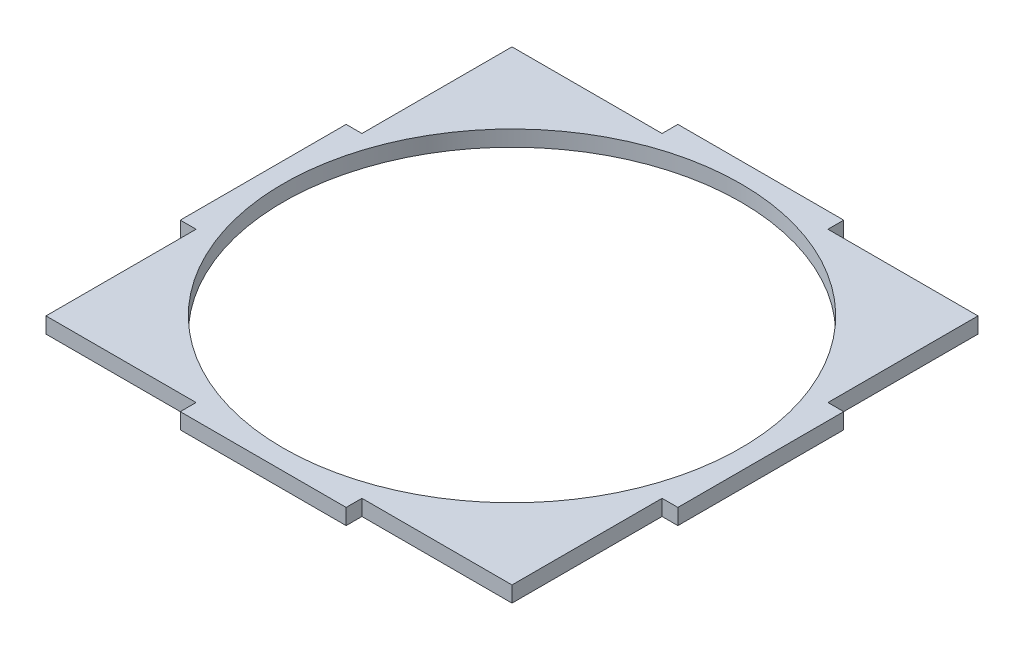
ISO-10303-21;
HEADER;
FILE_DESCRIPTION(('STEP AP214'),'2;1');
FILE_NAME('part.step','',(''),(''),'','','');
FILE_SCHEMA(('AUTOMOTIVE_DESIGN { 1 0 10303 214 1 1 1 1 }'));
ENDSEC;
DATA;
#1=APPLICATION_CONTEXT('core data for automotive mechanical design processes');
#2=APPLICATION_PROTOCOL_DEFINITION('international standard','automotive_design',2000,#1);
#3=PRODUCT_CONTEXT('',#1,'mechanical');
#4=PRODUCT('Part','Part','',(#3));
#5=PRODUCT_RELATED_PRODUCT_CATEGORY('part','',(#4));
#6=PRODUCT_DEFINITION_FORMATION('','',#4);
#7=PRODUCT_DEFINITION_CONTEXT('part definition',#1,'design');
#8=PRODUCT_DEFINITION('design','',#6,#7);
#9=PRODUCT_DEFINITION_SHAPE('','',#8);
#10=(LENGTH_UNIT() NAMED_UNIT(*) SI_UNIT(.MILLI.,.METRE.));
#11=(NAMED_UNIT(*) PLANE_ANGLE_UNIT() SI_UNIT($,.RADIAN.));
#12=(NAMED_UNIT(*) SI_UNIT($,.STERADIAN.) SOLID_ANGLE_UNIT());
#13=UNCERTAINTY_MEASURE_WITH_UNIT(LENGTH_MEASURE(1.E-05),#10,'distance_accuracy_value','');
#14=(GEOMETRIC_REPRESENTATION_CONTEXT(3) GLOBAL_UNCERTAINTY_ASSIGNED_CONTEXT((#13)) GLOBAL_UNIT_ASSIGNED_CONTEXT((#10,
#11,#12)) REPRESENTATION_CONTEXT('',''));
#15=CARTESIAN_POINT('',(0.,0.,0.));
#16=DIRECTION('',(0.,0.,1.));
#17=DIRECTION('',(1.,0.,0.));
#18=AXIS2_PLACEMENT_3D('',#15,#16,#17);
#19=CARTESIAN_POINT('',(0.,3.175,0.));
#20=DIRECTION('',(0.,-1.,0.));
#21=DIRECTION('',(0.,0.,-1.));
#22=AXIS2_PLACEMENT_3D('',#19,#20,#21);
#23=PLANE('',#22);
#24=DIRECTION('',(1.,0.,0.));
#25=VECTOR('',#24,1.);
#26=CARTESIAN_POINT('',(-50.,3.175,16.6666666666667));
#27=LINE('',#26,#25);
#28=CARTESIAN_POINT('',(-50.,3.175,16.6666666666667));
#29=VERTEX_POINT('',#28);
#30=CARTESIAN_POINT('',(-46.825,3.175,16.6666666666667));
#31=VERTEX_POINT('',#30);
#32=EDGE_CURVE('E272',#29,#31,#27,.T.);
#33=ORIENTED_EDGE('',*,*,#32,.T.);
#34=DIRECTION('',(0.,0.,1.));
#35=VECTOR('',#34,1.);
#36=CARTESIAN_POINT('',(-46.825,3.175,16.6666666666667));
#37=LINE('',#36,#35);
#38=CARTESIAN_POINT('',(-46.825,3.175,46.825));
#39=VERTEX_POINT('',#38);
#40=EDGE_CURVE('E136',#31,#39,#37,.T.);
#41=ORIENTED_EDGE('',*,*,#40,.T.);
#42=DIRECTION('',(1.,0.,0.));
#43=VECTOR('',#42,1.);
#44=CARTESIAN_POINT('',(-46.825,3.175,46.825));
#45=LINE('',#44,#43);
#46=CARTESIAN_POINT('',(-16.6666666666667,3.175,46.825));
#47=VERTEX_POINT('',#46);
#48=EDGE_CURVE('E341',#39,#47,#45,.T.);
#49=ORIENTED_EDGE('',*,*,#48,.T.);
#50=DIRECTION('',(0.,0.,1.));
#51=VECTOR('',#50,1.);
#52=CARTESIAN_POINT('',(-16.6666666666667,3.175,50.));
#53=LINE('',#52,#51);
#54=CARTESIAN_POINT('',(-16.6666666666667,3.175,50.));
#55=VERTEX_POINT('',#54);
#56=EDGE_CURVE('E361',#47,#55,#53,.T.);
#57=ORIENTED_EDGE('',*,*,#56,.T.);
#58=DIRECTION('',(1.,0.,0.));
#59=VECTOR('',#58,1.);
#60=CARTESIAN_POINT('',(-16.6666666666667,3.175,50.));
#61=LINE('',#60,#59);
#62=CARTESIAN_POINT('',(16.6666666666667,3.175,50.));
#63=VERTEX_POINT('',#62);
#64=EDGE_CURVE('E357',#55,#63,#61,.T.);
#65=ORIENTED_EDGE('',*,*,#64,.T.);
#66=DIRECTION('',(0.,0.,-1.));
#67=VECTOR('',#66,1.);
#68=CARTESIAN_POINT('',(16.6666666666667,3.175,50.));
#69=LINE('',#68,#67);
#70=CARTESIAN_POINT('',(16.6666666666667,3.175,46.825));
#71=VERTEX_POINT('',#70);
#72=EDGE_CURVE('E360',#63,#71,#69,.T.);
#73=ORIENTED_EDGE('',*,*,#72,.T.);
#74=DIRECTION('',(1.,0.,0.));
#75=VECTOR('',#74,1.);
#76=CARTESIAN_POINT('',(46.825,3.175,46.825));
#77=LINE('',#76,#75);
#78=CARTESIAN_POINT('',(46.825,3.175,46.825));
#79=VERTEX_POINT('',#78);
#80=EDGE_CURVE('E365',#71,#79,#77,.T.);
#81=ORIENTED_EDGE('',*,*,#80,.T.);
#82=DIRECTION('',(0.,0.,-1.));
#83=VECTOR('',#82,1.);
#84=CARTESIAN_POINT('',(46.825,3.175,16.6666666666667));
#85=LINE('',#84,#83);
#86=CARTESIAN_POINT('',(46.825,3.175,16.6666666666667));
#87=VERTEX_POINT('',#86);
#88=EDGE_CURVE('E372',#79,#87,#85,.T.);
#89=ORIENTED_EDGE('',*,*,#88,.T.);
#90=DIRECTION('',(1.,0.,0.));
#91=VECTOR('',#90,1.);
#92=CARTESIAN_POINT('',(50.,3.175,16.6666666666667));
#93=LINE('',#92,#91);
#94=CARTESIAN_POINT('',(50.,3.175,16.6666666666667));
#95=VERTEX_POINT('',#94);
#96=EDGE_CURVE('E375',#87,#95,#93,.T.);
#97=ORIENTED_EDGE('',*,*,#96,.T.);
#98=DIRECTION('',(0.,0.,-1.));
#99=VECTOR('',#98,1.);
#100=CARTESIAN_POINT('',(50.,3.175,16.6666666666667));
#101=LINE('',#100,#99);
#102=CARTESIAN_POINT('',(50.,3.175,-16.6666666666667));
#103=VERTEX_POINT('',#102);
#104=EDGE_CURVE('E378',#95,#103,#101,.T.);
#105=ORIENTED_EDGE('',*,*,#104,.T.);
#106=DIRECTION('',(-1.,0.,0.));
#107=VECTOR('',#106,1.);
#108=CARTESIAN_POINT('',(50.,3.175,-16.6666666666667));
#109=LINE('',#108,#107);
#110=CARTESIAN_POINT('',(46.825,3.175,-16.6666666666667));
#111=VERTEX_POINT('',#110);
#112=EDGE_CURVE('E381',#103,#111,#109,.T.);
#113=ORIENTED_EDGE('',*,*,#112,.T.);
#114=DIRECTION('',(0.,0.,-1.));
#115=VECTOR('',#114,1.);
#116=CARTESIAN_POINT('',(46.825,3.175,-46.825));
#117=LINE('',#116,#115);
#118=CARTESIAN_POINT('',(46.825,3.175,-46.825));
#119=VERTEX_POINT('',#118);
#120=EDGE_CURVE('E384',#111,#119,#117,.T.);
#121=ORIENTED_EDGE('',*,*,#120,.T.);
#122=DIRECTION('',(-1.,0.,0.));
#123=VECTOR('',#122,1.);
#124=CARTESIAN_POINT('',(16.6666666666667,3.175,-46.825));
#125=LINE('',#124,#123);
#126=CARTESIAN_POINT('',(16.6666666666667,3.175,-46.825));
#127=VERTEX_POINT('',#126);
#128=EDGE_CURVE('E387',#119,#127,#125,.T.);
#129=ORIENTED_EDGE('',*,*,#128,.T.);
#130=DIRECTION('',(0.,0.,-1.));
#131=VECTOR('',#130,1.);
#132=CARTESIAN_POINT('',(16.6666666666667,3.175,-50.));
#133=LINE('',#132,#131);
#134=CARTESIAN_POINT('',(16.6666666666667,3.175,-50.));
#135=VERTEX_POINT('',#134);
#136=EDGE_CURVE('E390',#127,#135,#133,.T.);
#137=ORIENTED_EDGE('',*,*,#136,.T.);
#138=DIRECTION('',(-1.,0.,0.));
#139=VECTOR('',#138,1.);
#140=CARTESIAN_POINT('',(-16.6666666666667,3.175,-50.));
#141=LINE('',#140,#139);
#142=CARTESIAN_POINT('',(-16.6666666666667,3.175,-50.));
#143=VERTEX_POINT('',#142);
#144=EDGE_CURVE('E393',#135,#143,#141,.T.);
#145=ORIENTED_EDGE('',*,*,#144,.T.);
#146=DIRECTION('',(0.,0.,1.));
#147=VECTOR('',#146,1.);
#148=CARTESIAN_POINT('',(-16.6666666666667,3.175,-50.));
#149=LINE('',#148,#147);
#150=CARTESIAN_POINT('',(-16.6666666666667,3.175,-46.825));
#151=VERTEX_POINT('',#150);
#152=EDGE_CURVE('E396',#143,#151,#149,.T.);
#153=ORIENTED_EDGE('',*,*,#152,.T.);
#154=DIRECTION('',(-1.,0.,0.));
#155=VECTOR('',#154,1.);
#156=CARTESIAN_POINT('',(-16.6666666666667,3.175,-46.825));
#157=LINE('',#156,#155);
#158=CARTESIAN_POINT('',(-46.825,3.175,-46.825));
#159=VERTEX_POINT('',#158);
#160=EDGE_CURVE('E191',#151,#159,#157,.T.);
#161=ORIENTED_EDGE('',*,*,#160,.T.);
#162=DIRECTION('',(0.,0.,1.));
#163=VECTOR('',#162,1.);
#164=CARTESIAN_POINT('',(-46.825,3.175,-46.825));
#165=LINE('',#164,#163);
#166=CARTESIAN_POINT('',(-46.825,3.175,-16.6666666666667));
#167=VERTEX_POINT('',#166);
#168=EDGE_CURVE('E185',#159,#167,#165,.T.);
#169=ORIENTED_EDGE('',*,*,#168,.T.);
#170=DIRECTION('',(-1.,0.,0.));
#171=VECTOR('',#170,1.);
#172=CARTESIAN_POINT('',(-50.,3.175,-16.6666666666667));
#173=LINE('',#172,#171);
#174=CARTESIAN_POINT('',(-50.,3.175,-16.6666666666667));
#175=VERTEX_POINT('',#174);
#176=EDGE_CURVE('E189',#167,#175,#173,.T.);
#177=ORIENTED_EDGE('',*,*,#176,.T.);
#178=DIRECTION('',(0.,0.,1.));
#179=VECTOR('',#178,1.);
#180=CARTESIAN_POINT('',(-50.,3.175,16.6666666666667));
#181=LINE('',#180,#179);
#182=EDGE_CURVE('E57',#175,#29,#181,.T.);
#183=ORIENTED_EDGE('',*,*,#182,.T.);
#184=EDGE_LOOP('',(#33,#41,#49,#57,#65,#73,#81,#89,#97,#105,#113,#121,#129,#137,#145,#153,#161,
#169,#177,#183));
#185=FACE_BOUND('',#184,.T.);
#186=CARTESIAN_POINT('',(0.,3.175,0.));
#187=DIRECTION('',(0.,1.,0.));
#188=DIRECTION('',(0.,0.,1.));
#189=AXIS2_PLACEMENT_3D('',#186,#187,#188);
#190=CIRCLE('',#189,46.);
#191=CARTESIAN_POINT('',(0.,3.175,46.));
#192=VERTEX_POINT('',#191);
#193=EDGE_CURVE('E218',#192,#192,#190,.T.);
#194=ORIENTED_EDGE('',*,*,#193,.F.);
#195=EDGE_LOOP('',(#194));
#196=FACE_BOUND('',#195,.T.);
#197=ADVANCED_FACE('F39',(#185,#196),#23,.F.);
#198=CARTESIAN_POINT('',(0.,0.,0.));
#199=DIRECTION('',(0.,-1.,0.));
#200=DIRECTION('',(0.,0.,-1.));
#201=AXIS2_PLACEMENT_3D('',#198,#199,#200);
#202=PLANE('',#201);
#203=DIRECTION('',(1.,0.,0.));
#204=VECTOR('',#203,1.);
#205=CARTESIAN_POINT('',(-50.,0.,16.6666666666667));
#206=LINE('',#205,#204);
#207=CARTESIAN_POINT('',(-50.,0.,16.6666666666667));
#208=VERTEX_POINT('',#207);
#209=CARTESIAN_POINT('',(-46.825,0.,16.6666666666667));
#210=VERTEX_POINT('',#209);
#211=EDGE_CURVE('E213',#208,#210,#206,.T.);
#212=ORIENTED_EDGE('',*,*,#211,.F.);
#213=DIRECTION('',(0.,0.,1.));
#214=VECTOR('',#213,1.);
#215=CARTESIAN_POINT('',(-50.,0.,16.6666666666667));
#216=LINE('',#215,#214);
#217=CARTESIAN_POINT('',(-50.,0.,-16.6666666666667));
#218=VERTEX_POINT('',#217);
#219=EDGE_CURVE('E128',#218,#208,#216,.T.);
#220=ORIENTED_EDGE('',*,*,#219,.F.);
#221=DIRECTION('',(-1.,0.,0.));
#222=VECTOR('',#221,1.);
#223=CARTESIAN_POINT('',(-50.,0.,-16.6666666666667));
#224=LINE('',#223,#222);
#225=CARTESIAN_POINT('',(-46.825,0.,-16.6666666666667));
#226=VERTEX_POINT('',#225);
#227=EDGE_CURVE('E122',#226,#218,#224,.T.);
#228=ORIENTED_EDGE('',*,*,#227,.F.);
#229=DIRECTION('',(0.,0.,1.));
#230=VECTOR('',#229,1.);
#231=CARTESIAN_POINT('',(-46.825,0.,-46.825));
#232=LINE('',#231,#230);
#233=CARTESIAN_POINT('',(-46.825,0.,-46.825));
#234=VERTEX_POINT('',#233);
#235=EDGE_CURVE('E200',#234,#226,#232,.T.);
#236=ORIENTED_EDGE('',*,*,#235,.F.);
#237=DIRECTION('',(-1.,0.,0.));
#238=VECTOR('',#237,1.);
#239=CARTESIAN_POINT('',(-16.6666666666667,0.,-46.825));
#240=LINE('',#239,#238);
#241=CARTESIAN_POINT('',(-16.6666666666667,0.,-46.825));
#242=VERTEX_POINT('',#241);
#243=EDGE_CURVE('E263',#242,#234,#240,.T.);
#244=ORIENTED_EDGE('',*,*,#243,.F.);
#245=DIRECTION('',(0.,0.,1.));
#246=VECTOR('',#245,1.);
#247=CARTESIAN_POINT('',(-16.6666666666667,0.,-50.));
#248=LINE('',#247,#246);
#249=CARTESIAN_POINT('',(-16.6666666666667,0.,-50.));
#250=VERTEX_POINT('',#249);
#251=EDGE_CURVE('E260',#250,#242,#248,.T.);
#252=ORIENTED_EDGE('',*,*,#251,.F.);
#253=DIRECTION('',(-1.,0.,0.));
#254=VECTOR('',#253,1.);
#255=CARTESIAN_POINT('',(-16.6666666666667,0.,-50.));
#256=LINE('',#255,#254);
#257=CARTESIAN_POINT('',(16.6666666666667,0.,-50.));
#258=VERTEX_POINT('',#257);
#259=EDGE_CURVE('E257',#258,#250,#256,.T.);
#260=ORIENTED_EDGE('',*,*,#259,.F.);
#261=DIRECTION('',(0.,0.,-1.));
#262=VECTOR('',#261,1.);
#263=CARTESIAN_POINT('',(16.6666666666667,0.,-50.));
#264=LINE('',#263,#262);
#265=CARTESIAN_POINT('',(16.6666666666667,0.,-46.825));
#266=VERTEX_POINT('',#265);
#267=EDGE_CURVE('E254',#266,#258,#264,.T.);
#268=ORIENTED_EDGE('',*,*,#267,.F.);
#269=DIRECTION('',(-1.,0.,0.));
#270=VECTOR('',#269,1.);
#271=CARTESIAN_POINT('',(16.6666666666667,0.,-46.825));
#272=LINE('',#271,#270);
#273=CARTESIAN_POINT('',(46.825,0.,-46.825));
#274=VERTEX_POINT('',#273);
#275=EDGE_CURVE('E251',#274,#266,#272,.T.);
#276=ORIENTED_EDGE('',*,*,#275,.F.);
#277=DIRECTION('',(0.,0.,-1.));
#278=VECTOR('',#277,1.);
#279=CARTESIAN_POINT('',(46.825,0.,-46.825));
#280=LINE('',#279,#278);
#281=CARTESIAN_POINT('',(46.825,0.,-16.6666666666667));
#282=VERTEX_POINT('',#281);
#283=EDGE_CURVE('E248',#282,#274,#280,.T.);
#284=ORIENTED_EDGE('',*,*,#283,.F.);
#285=DIRECTION('',(-1.,0.,0.));
#286=VECTOR('',#285,1.);
#287=CARTESIAN_POINT('',(50.,0.,-16.6666666666667));
#288=LINE('',#287,#286);
#289=CARTESIAN_POINT('',(50.,0.,-16.6666666666667));
#290=VERTEX_POINT('',#289);
#291=EDGE_CURVE('E245',#290,#282,#288,.T.);
#292=ORIENTED_EDGE('',*,*,#291,.F.);
#293=DIRECTION('',(0.,0.,-1.));
#294=VECTOR('',#293,1.);
#295=CARTESIAN_POINT('',(50.,0.,16.6666666666667));
#296=LINE('',#295,#294);
#297=CARTESIAN_POINT('',(50.,0.,16.6666666666667));
#298=VERTEX_POINT('',#297);
#299=EDGE_CURVE('E242',#298,#290,#296,.T.);
#300=ORIENTED_EDGE('',*,*,#299,.F.);
#301=DIRECTION('',(1.,0.,0.));
#302=VECTOR('',#301,1.);
#303=CARTESIAN_POINT('',(50.,0.,16.6666666666667));
#304=LINE('',#303,#302);
#305=CARTESIAN_POINT('',(46.825,0.,16.6666666666667));
#306=VERTEX_POINT('',#305);
#307=EDGE_CURVE('E239',#306,#298,#304,.T.);
#308=ORIENTED_EDGE('',*,*,#307,.F.);
#309=DIRECTION('',(0.,0.,-1.));
#310=VECTOR('',#309,1.);
#311=CARTESIAN_POINT('',(46.825,0.,16.6666666666667));
#312=LINE('',#311,#310);
#313=CARTESIAN_POINT('',(46.825,0.,46.825));
#314=VERTEX_POINT('',#313);
#315=EDGE_CURVE('E236',#314,#306,#312,.T.);
#316=ORIENTED_EDGE('',*,*,#315,.F.);
#317=DIRECTION('',(1.,0.,0.));
#318=VECTOR('',#317,1.);
#319=CARTESIAN_POINT('',(46.825,0.,46.825));
#320=LINE('',#319,#318);
#321=CARTESIAN_POINT('',(16.6666666666667,0.,46.825));
#322=VERTEX_POINT('',#321);
#323=EDGE_CURVE('E233',#322,#314,#320,.T.);
#324=ORIENTED_EDGE('',*,*,#323,.F.);
#325=DIRECTION('',(0.,0.,-1.));
#326=VECTOR('',#325,1.);
#327=CARTESIAN_POINT('',(16.6666666666667,0.,50.));
#328=LINE('',#327,#326);
#329=CARTESIAN_POINT('',(16.6666666666667,0.,50.));
#330=VERTEX_POINT('',#329);
#331=EDGE_CURVE('E230',#330,#322,#328,.T.);
#332=ORIENTED_EDGE('',*,*,#331,.F.);
#333=DIRECTION('',(1.,0.,0.));
#334=VECTOR('',#333,1.);
#335=CARTESIAN_POINT('',(-16.6666666666667,0.,50.));
#336=LINE('',#335,#334);
#337=CARTESIAN_POINT('',(-16.6666666666667,0.,50.));
#338=VERTEX_POINT('',#337);
#339=EDGE_CURVE('E227',#338,#330,#336,.T.);
#340=ORIENTED_EDGE('',*,*,#339,.F.);
#341=DIRECTION('',(0.,0.,1.));
#342=VECTOR('',#341,1.);
#343=CARTESIAN_POINT('',(-16.6666666666667,0.,50.));
#344=LINE('',#343,#342);
#345=CARTESIAN_POINT('',(-16.6666666666667,0.,46.825));
#346=VERTEX_POINT('',#345);
#347=EDGE_CURVE('E224',#346,#338,#344,.T.);
#348=ORIENTED_EDGE('',*,*,#347,.F.);
#349=DIRECTION('',(1.,0.,0.));
#350=VECTOR('',#349,1.);
#351=CARTESIAN_POINT('',(-46.825,0.,46.825));
#352=LINE('',#351,#350);
#353=CARTESIAN_POINT('',(-46.825,0.,46.825));
#354=VERTEX_POINT('',#353);
#355=EDGE_CURVE('E221',#354,#346,#352,.T.);
#356=ORIENTED_EDGE('',*,*,#355,.F.);
#357=DIRECTION('',(0.,0.,1.));
#358=VECTOR('',#357,1.);
#359=CARTESIAN_POINT('',(-46.825,0.,16.6666666666667));
#360=LINE('',#359,#358);
#361=EDGE_CURVE('E217',#210,#354,#360,.T.);
#362=ORIENTED_EDGE('',*,*,#361,.F.);
#363=EDGE_LOOP('',(#212,#220,#228,#236,#244,#252,#260,#268,#276,#284,#292,#300,#308,#316,#324,
#332,#340,#348,#356,#362));
#364=FACE_BOUND('',#363,.T.);
#365=CARTESIAN_POINT('',(0.,0.,0.));
#366=DIRECTION('',(0.,1.,0.));
#367=DIRECTION('',(0.,0.,1.));
#368=AXIS2_PLACEMENT_3D('',#365,#366,#367);
#369=CIRCLE('',#368,46.);
#370=CARTESIAN_POINT('',(0.,0.,46.));
#371=VERTEX_POINT('',#370);
#372=EDGE_CURVE('E649',#371,#371,#369,.T.);
#373=ORIENTED_EDGE('',*,*,#372,.T.);
#374=EDGE_LOOP('',(#373));
#375=FACE_BOUND('',#374,.T.);
#376=ADVANCED_FACE('F345',(#364,#375),#202,.T.);
#377=CARTESIAN_POINT('',(-50.,3.175,16.6666666666667));
#378=DIRECTION('',(0.,0.,-1.));
#379=DIRECTION('',(-1.,0.,0.));
#380=AXIS2_PLACEMENT_3D('',#377,#378,#379);
#381=PLANE('',#380);
#382=ORIENTED_EDGE('',*,*,#211,.T.);
#383=DIRECTION('',(0.,-1.,0.));
#384=VECTOR('',#383,1.);
#385=CARTESIAN_POINT('',(-46.825,3.175,16.6666666666667));
#386=LINE('',#385,#384);
#387=EDGE_CURVE('E11',#31,#210,#386,.T.);
#388=ORIENTED_EDGE('',*,*,#387,.F.);
#389=ORIENTED_EDGE('',*,*,#32,.F.);
#390=DIRECTION('',(0.,-1.,0.));
#391=VECTOR('',#390,1.);
#392=CARTESIAN_POINT('',(-50.,3.175,16.6666666666667));
#393=LINE('',#392,#391);
#394=EDGE_CURVE('E209',#29,#208,#393,.T.);
#395=ORIENTED_EDGE('',*,*,#394,.T.);
#396=EDGE_LOOP('',(#382,#388,#389,#395));
#397=FACE_BOUND('',#396,.T.);
#398=ADVANCED_FACE('F41',(#397),#381,.F.);
#399=CARTESIAN_POINT('',(-46.825,3.175,16.6666666666667));
#400=DIRECTION('',(1.,0.,0.));
#401=DIRECTION('',(0.,0.,-1.));
#402=AXIS2_PLACEMENT_3D('',#399,#400,#401);
#403=PLANE('',#402);
#404=ORIENTED_EDGE('',*,*,#361,.T.);
#405=DIRECTION('',(0.,-1.,0.));
#406=VECTOR('',#405,1.);
#407=CARTESIAN_POINT('',(-46.825,3.175,46.825));
#408=LINE('',#407,#406);
#409=EDGE_CURVE('E49',#39,#354,#408,.T.);
#410=ORIENTED_EDGE('',*,*,#409,.F.);
#411=ORIENTED_EDGE('',*,*,#40,.F.);
#412=ORIENTED_EDGE('',*,*,#387,.T.);
#413=EDGE_LOOP('',(#404,#410,#411,#412));
#414=FACE_BOUND('',#413,.T.);
#415=ADVANCED_FACE('F432',(#414),#403,.F.);
#416=CARTESIAN_POINT('',(-46.825,3.175,46.825));
#417=DIRECTION('',(0.,0.,-1.));
#418=DIRECTION('',(-1.,0.,0.));
#419=AXIS2_PLACEMENT_3D('',#416,#417,#418);
#420=PLANE('',#419);
#421=ORIENTED_EDGE('',*,*,#355,.T.);
#422=DIRECTION('',(0.,-1.,0.));
#423=VECTOR('',#422,1.);
#424=CARTESIAN_POINT('',(-16.6666666666667,3.175,46.825));
#425=LINE('',#424,#423);
#426=EDGE_CURVE('E331',#47,#346,#425,.T.);
#427=ORIENTED_EDGE('',*,*,#426,.F.);
#428=ORIENTED_EDGE('',*,*,#48,.F.);
#429=ORIENTED_EDGE('',*,*,#409,.T.);
#430=EDGE_LOOP('',(#421,#427,#428,#429));
#431=FACE_BOUND('',#430,.T.);
#432=ADVANCED_FACE('F339',(#431),#420,.F.);
#433=CARTESIAN_POINT('',(-16.6666666666667,3.175,50.));
#434=DIRECTION('',(1.,0.,0.));
#435=DIRECTION('',(0.,0.,-1.));
#436=AXIS2_PLACEMENT_3D('',#433,#434,#435);
#437=PLANE('',#436);
#438=ORIENTED_EDGE('',*,*,#347,.T.);
#439=DIRECTION('',(0.,-1.,0.));
#440=VECTOR('',#439,1.);
#441=CARTESIAN_POINT('',(-16.6666666666667,3.175,50.));
#442=LINE('',#441,#440);
#443=EDGE_CURVE('E327',#55,#338,#442,.T.);
#444=ORIENTED_EDGE('',*,*,#443,.F.);
#445=ORIENTED_EDGE('',*,*,#56,.F.);
#446=ORIENTED_EDGE('',*,*,#426,.T.);
#447=EDGE_LOOP('',(#438,#444,#445,#446));
#448=FACE_BOUND('',#447,.T.);
#449=ADVANCED_FACE('F351',(#448),#437,.F.);
#450=CARTESIAN_POINT('',(-16.6666666666667,3.175,50.));
#451=DIRECTION('',(0.,0.,-1.));
#452=DIRECTION('',(-1.,0.,0.));
#453=AXIS2_PLACEMENT_3D('',#450,#451,#452);
#454=PLANE('',#453);
#455=ORIENTED_EDGE('',*,*,#339,.T.);
#456=DIRECTION('',(0.,-1.,0.));
#457=VECTOR('',#456,1.);
#458=CARTESIAN_POINT('',(16.6666666666667,3.175,50.));
#459=LINE('',#458,#457);
#460=EDGE_CURVE('E323',#63,#330,#459,.T.);
#461=ORIENTED_EDGE('',*,*,#460,.F.);
#462=ORIENTED_EDGE('',*,*,#64,.F.);
#463=ORIENTED_EDGE('',*,*,#443,.T.);
#464=EDGE_LOOP('',(#455,#461,#462,#463));
#465=FACE_BOUND('',#464,.T.);
#466=ADVANCED_FACE('F355',(#465),#454,.F.);
#467=CARTESIAN_POINT('',(16.6666666666667,3.175,50.));
#468=DIRECTION('',(-1.,0.,0.));
#469=DIRECTION('',(0.,0.,1.));
#470=AXIS2_PLACEMENT_3D('',#467,#468,#469);
#471=PLANE('',#470);
#472=ORIENTED_EDGE('',*,*,#331,.T.);
#473=DIRECTION('',(0.,-1.,0.));
#474=VECTOR('',#473,1.);
#475=CARTESIAN_POINT('',(16.6666666666667,3.175,46.825));
#476=LINE('',#475,#474);
#477=EDGE_CURVE('E319',#71,#322,#476,.T.);
#478=ORIENTED_EDGE('',*,*,#477,.F.);
#479=ORIENTED_EDGE('',*,*,#72,.F.);
#480=ORIENTED_EDGE('',*,*,#460,.T.);
#481=EDGE_LOOP('',(#472,#478,#479,#480));
#482=FACE_BOUND('',#481,.T.);
#483=ADVANCED_FACE('F445',(#482),#471,.F.);
#484=CARTESIAN_POINT('',(46.825,3.175,46.825));
#485=DIRECTION('',(0.,0.,-1.));
#486=DIRECTION('',(-1.,0.,0.));
#487=AXIS2_PLACEMENT_3D('',#484,#485,#486);
#488=PLANE('',#487);
#489=ORIENTED_EDGE('',*,*,#323,.T.);
#490=DIRECTION('',(0.,-1.,0.));
#491=VECTOR('',#490,1.);
#492=CARTESIAN_POINT('',(46.825,3.175,46.825));
#493=LINE('',#492,#491);
#494=EDGE_CURVE('E315',#79,#314,#493,.T.);
#495=ORIENTED_EDGE('',*,*,#494,.F.);
#496=ORIENTED_EDGE('',*,*,#80,.F.);
#497=ORIENTED_EDGE('',*,*,#477,.T.);
#498=EDGE_LOOP('',(#489,#495,#496,#497));
#499=FACE_BOUND('',#498,.T.);
#500=ADVANCED_FACE('F448',(#499),#488,.F.);
#501=CARTESIAN_POINT('',(46.825,3.175,16.6666666666667));
#502=DIRECTION('',(-1.,0.,0.));
#503=DIRECTION('',(0.,0.,1.));
#504=AXIS2_PLACEMENT_3D('',#501,#502,#503);
#505=PLANE('',#504);
#506=ORIENTED_EDGE('',*,*,#315,.T.);
#507=DIRECTION('',(0.,-1.,0.));
#508=VECTOR('',#507,1.);
#509=CARTESIAN_POINT('',(46.825,3.175,16.6666666666667));
#510=LINE('',#509,#508);
#511=EDGE_CURVE('E311',#87,#306,#510,.T.);
#512=ORIENTED_EDGE('',*,*,#511,.F.);
#513=ORIENTED_EDGE('',*,*,#88,.F.);
#514=ORIENTED_EDGE('',*,*,#494,.T.);
#515=EDGE_LOOP('',(#506,#512,#513,#514));
#516=FACE_BOUND('',#515,.T.);
#517=ADVANCED_FACE('F452',(#516),#505,.F.);
#518=CARTESIAN_POINT('',(50.,3.175,16.6666666666667));
#519=DIRECTION('',(0.,0.,-1.));
#520=DIRECTION('',(-1.,0.,0.));
#521=AXIS2_PLACEMENT_3D('',#518,#519,#520);
#522=PLANE('',#521);
#523=ORIENTED_EDGE('',*,*,#307,.T.);
#524=DIRECTION('',(0.,-1.,0.));
#525=VECTOR('',#524,1.);
#526=CARTESIAN_POINT('',(50.,3.175,16.6666666666667));
#527=LINE('',#526,#525);
#528=EDGE_CURVE('E307',#95,#298,#527,.T.);
#529=ORIENTED_EDGE('',*,*,#528,.F.);
#530=ORIENTED_EDGE('',*,*,#96,.F.);
#531=ORIENTED_EDGE('',*,*,#511,.T.);
#532=EDGE_LOOP('',(#523,#529,#530,#531));
#533=FACE_BOUND('',#532,.T.);
#534=ADVANCED_FACE('F456',(#533),#522,.F.);
#535=CARTESIAN_POINT('',(50.,3.175,16.6666666666667));
#536=DIRECTION('',(-1.,0.,0.));
#537=DIRECTION('',(0.,0.,1.));
#538=AXIS2_PLACEMENT_3D('',#535,#536,#537);
#539=PLANE('',#538);
#540=ORIENTED_EDGE('',*,*,#299,.T.);
#541=DIRECTION('',(0.,-1.,0.));
#542=VECTOR('',#541,1.);
#543=CARTESIAN_POINT('',(50.,3.175,-16.6666666666667));
#544=LINE('',#543,#542);
#545=EDGE_CURVE('E303',#103,#290,#544,.T.);
#546=ORIENTED_EDGE('',*,*,#545,.F.);
#547=ORIENTED_EDGE('',*,*,#104,.F.);
#548=ORIENTED_EDGE('',*,*,#528,.T.);
#549=EDGE_LOOP('',(#540,#546,#547,#548));
#550=FACE_BOUND('',#549,.T.);
#551=ADVANCED_FACE('F460',(#550),#539,.F.);
#552=CARTESIAN_POINT('',(50.,3.175,-16.6666666666667));
#553=DIRECTION('',(0.,0.,1.));
#554=DIRECTION('',(1.,0.,0.));
#555=AXIS2_PLACEMENT_3D('',#552,#553,#554);
#556=PLANE('',#555);
#557=ORIENTED_EDGE('',*,*,#291,.T.);
#558=DIRECTION('',(0.,-1.,0.));
#559=VECTOR('',#558,1.);
#560=CARTESIAN_POINT('',(46.825,3.175,-16.6666666666667));
#561=LINE('',#560,#559);
#562=EDGE_CURVE('E299',#111,#282,#561,.T.);
#563=ORIENTED_EDGE('',*,*,#562,.F.);
#564=ORIENTED_EDGE('',*,*,#112,.F.);
#565=ORIENTED_EDGE('',*,*,#545,.T.);
#566=EDGE_LOOP('',(#557,#563,#564,#565));
#567=FACE_BOUND('',#566,.T.);
#568=ADVANCED_FACE('F464',(#567),#556,.F.);
#569=CARTESIAN_POINT('',(46.825,3.175,-46.825));
#570=DIRECTION('',(-1.,0.,0.));
#571=DIRECTION('',(0.,0.,1.));
#572=AXIS2_PLACEMENT_3D('',#569,#570,#571);
#573=PLANE('',#572);
#574=ORIENTED_EDGE('',*,*,#283,.T.);
#575=DIRECTION('',(0.,-1.,0.));
#576=VECTOR('',#575,1.);
#577=CARTESIAN_POINT('',(46.825,3.175,-46.825));
#578=LINE('',#577,#576);
#579=EDGE_CURVE('E295',#119,#274,#578,.T.);
#580=ORIENTED_EDGE('',*,*,#579,.F.);
#581=ORIENTED_EDGE('',*,*,#120,.F.);
#582=ORIENTED_EDGE('',*,*,#562,.T.);
#583=EDGE_LOOP('',(#574,#580,#581,#582));
#584=FACE_BOUND('',#583,.T.);
#585=ADVANCED_FACE('F468',(#584),#573,.F.);
#586=CARTESIAN_POINT('',(16.6666666666667,3.175,-46.825));
#587=DIRECTION('',(0.,0.,1.));
#588=DIRECTION('',(1.,0.,0.));
#589=AXIS2_PLACEMENT_3D('',#586,#587,#588);
#590=PLANE('',#589);
#591=ORIENTED_EDGE('',*,*,#275,.T.);
#592=DIRECTION('',(0.,-1.,0.));
#593=VECTOR('',#592,1.);
#594=CARTESIAN_POINT('',(16.6666666666667,3.175,-46.825));
#595=LINE('',#594,#593);
#596=EDGE_CURVE('E291',#127,#266,#595,.T.);
#597=ORIENTED_EDGE('',*,*,#596,.F.);
#598=ORIENTED_EDGE('',*,*,#128,.F.);
#599=ORIENTED_EDGE('',*,*,#579,.T.);
#600=EDGE_LOOP('',(#591,#597,#598,#599));
#601=FACE_BOUND('',#600,.T.);
#602=ADVANCED_FACE('F472',(#601),#590,.F.);
#603=CARTESIAN_POINT('',(16.6666666666667,3.175,-50.));
#604=DIRECTION('',(-1.,0.,0.));
#605=DIRECTION('',(0.,0.,1.));
#606=AXIS2_PLACEMENT_3D('',#603,#604,#605);
#607=PLANE('',#606);
#608=ORIENTED_EDGE('',*,*,#267,.T.);
#609=DIRECTION('',(0.,-1.,0.));
#610=VECTOR('',#609,1.);
#611=CARTESIAN_POINT('',(16.6666666666667,3.175,-50.));
#612=LINE('',#611,#610);
#613=EDGE_CURVE('E287',#135,#258,#612,.T.);
#614=ORIENTED_EDGE('',*,*,#613,.F.);
#615=ORIENTED_EDGE('',*,*,#136,.F.);
#616=ORIENTED_EDGE('',*,*,#596,.T.);
#617=EDGE_LOOP('',(#608,#614,#615,#616));
#618=FACE_BOUND('',#617,.T.);
#619=ADVANCED_FACE('F476',(#618),#607,.F.);
#620=CARTESIAN_POINT('',(-16.6666666666667,3.175,-50.));
#621=DIRECTION('',(0.,0.,1.));
#622=DIRECTION('',(1.,0.,0.));
#623=AXIS2_PLACEMENT_3D('',#620,#621,#622);
#624=PLANE('',#623);
#625=ORIENTED_EDGE('',*,*,#259,.T.);
#626=DIRECTION('',(0.,-1.,0.));
#627=VECTOR('',#626,1.);
#628=CARTESIAN_POINT('',(-16.6666666666667,3.175,-50.));
#629=LINE('',#628,#627);
#630=EDGE_CURVE('E283',#143,#250,#629,.T.);
#631=ORIENTED_EDGE('',*,*,#630,.F.);
#632=ORIENTED_EDGE('',*,*,#144,.F.);
#633=ORIENTED_EDGE('',*,*,#613,.T.);
#634=EDGE_LOOP('',(#625,#631,#632,#633));
#635=FACE_BOUND('',#634,.T.);
#636=ADVANCED_FACE('F480',(#635),#624,.F.);
#637=CARTESIAN_POINT('',(-16.6666666666667,3.175,-50.));
#638=DIRECTION('',(1.,0.,0.));
#639=DIRECTION('',(0.,0.,-1.));
#640=AXIS2_PLACEMENT_3D('',#637,#638,#639);
#641=PLANE('',#640);
#642=ORIENTED_EDGE('',*,*,#251,.T.);
#643=DIRECTION('',(0.,-1.,0.));
#644=VECTOR('',#643,1.);
#645=CARTESIAN_POINT('',(-16.6666666666667,3.175,-46.825));
#646=LINE('',#645,#644);
#647=EDGE_CURVE('E279',#151,#242,#646,.T.);
#648=ORIENTED_EDGE('',*,*,#647,.F.);
#649=ORIENTED_EDGE('',*,*,#152,.F.);
#650=ORIENTED_EDGE('',*,*,#630,.T.);
#651=EDGE_LOOP('',(#642,#648,#649,#650));
#652=FACE_BOUND('',#651,.T.);
#653=ADVANCED_FACE('F404',(#652),#641,.F.);
#654=CARTESIAN_POINT('',(-16.6666666666667,3.175,-46.825));
#655=DIRECTION('',(0.,0.,1.));
#656=DIRECTION('',(1.,0.,0.));
#657=AXIS2_PLACEMENT_3D('',#654,#655,#656);
#658=PLANE('',#657);
#659=ORIENTED_EDGE('',*,*,#243,.T.);
#660=DIRECTION('',(0.,-1.,0.));
#661=VECTOR('',#660,1.);
#662=CARTESIAN_POINT('',(-46.825,3.175,-46.825));
#663=LINE('',#662,#661);
#664=EDGE_CURVE('E202',#159,#234,#663,.T.);
#665=ORIENTED_EDGE('',*,*,#664,.F.);
#666=ORIENTED_EDGE('',*,*,#160,.F.);
#667=ORIENTED_EDGE('',*,*,#647,.T.);
#668=EDGE_LOOP('',(#659,#665,#666,#667));
#669=FACE_BOUND('',#668,.T.);
#670=ADVANCED_FACE('F408',(#669),#658,.F.);
#671=CARTESIAN_POINT('',(-46.825,3.175,-46.825));
#672=DIRECTION('',(1.,0.,0.));
#673=DIRECTION('',(0.,0.,-1.));
#674=AXIS2_PLACEMENT_3D('',#671,#672,#673);
#675=PLANE('',#674);
#676=ORIENTED_EDGE('',*,*,#235,.T.);
#677=DIRECTION('',(0.,-1.,0.));
#678=VECTOR('',#677,1.);
#679=CARTESIAN_POINT('',(-46.825,3.175,-16.6666666666667));
#680=LINE('',#679,#678);
#681=EDGE_CURVE('E197',#167,#226,#680,.T.);
#682=ORIENTED_EDGE('',*,*,#681,.F.);
#683=ORIENTED_EDGE('',*,*,#168,.F.);
#684=ORIENTED_EDGE('',*,*,#664,.T.);
#685=EDGE_LOOP('',(#676,#682,#683,#684));
#686=FACE_BOUND('',#685,.T.);
#687=ADVANCED_FACE('F198',(#686),#675,.F.);
#688=CARTESIAN_POINT('',(-50.,3.175,-16.6666666666667));
#689=DIRECTION('',(0.,0.,1.));
#690=DIRECTION('',(1.,0.,0.));
#691=AXIS2_PLACEMENT_3D('',#688,#689,#690);
#692=PLANE('',#691);
#693=ORIENTED_EDGE('',*,*,#227,.T.);
#694=DIRECTION('',(0.,-1.,0.));
#695=VECTOR('',#694,1.);
#696=CARTESIAN_POINT('',(-50.,3.175,-16.6666666666667));
#697=LINE('',#696,#695);
#698=EDGE_CURVE('E203',#175,#218,#697,.T.);
#699=ORIENTED_EDGE('',*,*,#698,.F.);
#700=ORIENTED_EDGE('',*,*,#176,.F.);
#701=ORIENTED_EDGE('',*,*,#681,.T.);
#702=EDGE_LOOP('',(#693,#699,#700,#701));
#703=FACE_BOUND('',#702,.T.);
#704=ADVANCED_FACE('F205',(#703),#692,.F.);
#705=CARTESIAN_POINT('',(-50.,3.175,16.6666666666667));
#706=DIRECTION('',(1.,0.,0.));
#707=DIRECTION('',(0.,0.,-1.));
#708=AXIS2_PLACEMENT_3D('',#705,#706,#707);
#709=PLANE('',#708);
#710=ORIENTED_EDGE('',*,*,#219,.T.);
#711=ORIENTED_EDGE('',*,*,#394,.F.);
#712=ORIENTED_EDGE('',*,*,#182,.F.);
#713=ORIENTED_EDGE('',*,*,#698,.T.);
#714=EDGE_LOOP('',(#710,#711,#712,#713));
#715=FACE_BOUND('',#714,.T.);
#716=ADVANCED_FACE('F412',(#715),#709,.F.);
#717=CARTESIAN_POINT('',(0.,3.175,0.));
#718=DIRECTION('',(0.,-1.,0.));
#719=DIRECTION('',(0.,0.,-1.));
#720=AXIS2_PLACEMENT_3D('',#717,#718,#719);
#721=CYLINDRICAL_SURFACE('',#720,46.);
#722=ORIENTED_EDGE('',*,*,#193,.T.);
#723=EDGE_LOOP('',(#722));
#724=FACE_BOUND('',#723,.T.);
#725=ORIENTED_EDGE('',*,*,#372,.F.);
#726=EDGE_LOOP('',(#725));
#727=FACE_BOUND('',#726,.T.);
#728=ADVANCED_FACE('F414',(#724,#727),#721,.F.);
#729=CLOSED_SHELL('',(#197,#376,#398,#415,#432,#449,#466,#483,#500,#517,#534,#551,#568,#585,
#602,#619,#636,#653,#670,#687,#704,#716,#728));
#730=MANIFOLD_SOLID_BREP('B2',#729);
#731=ADVANCED_BREP_SHAPE_REPRESENTATION('',(#18,#730),#14);
#732=SHAPE_DEFINITION_REPRESENTATION(#9,#731);
ENDSEC;
END-ISO-10303-21;
